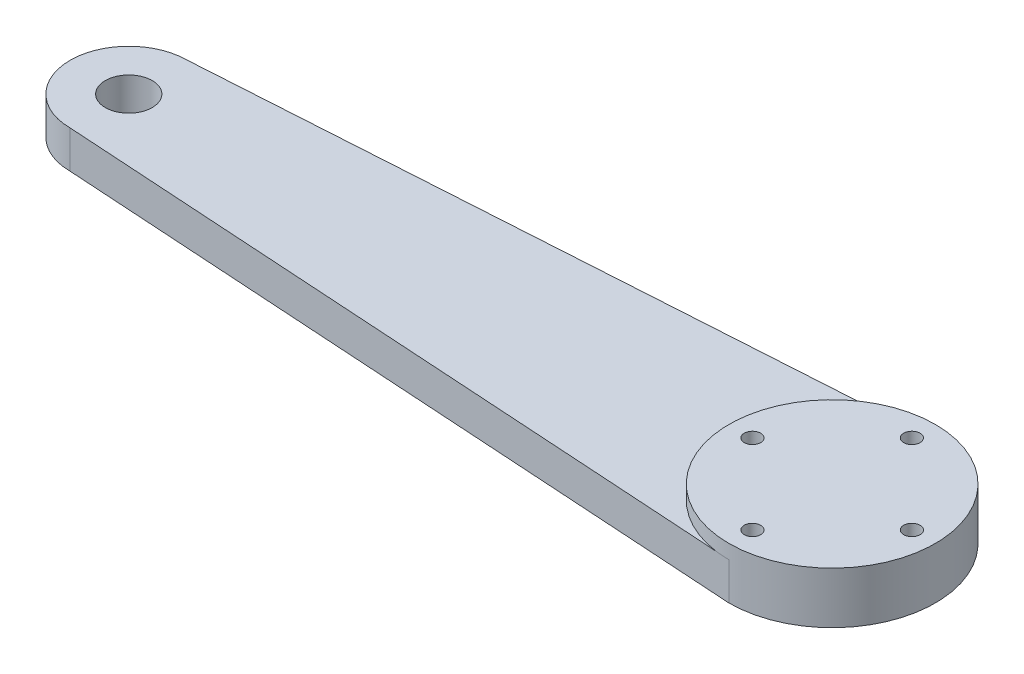
ISO-10303-21;
HEADER;
FILE_DESCRIPTION(('STEP AP214'),'2;1');
FILE_NAME('part.step','',(''),(''),'','','');
FILE_SCHEMA(('AUTOMOTIVE_DESIGN { 1 0 10303 214 1 1 1 1 }'));
ENDSEC;
DATA;
#1=APPLICATION_CONTEXT('core data for automotive mechanical design processes');
#2=APPLICATION_PROTOCOL_DEFINITION('international standard','automotive_design',2000,#1);
#3=PRODUCT_CONTEXT('',#1,'mechanical');
#4=PRODUCT('Part','Part','',(#3));
#5=PRODUCT_RELATED_PRODUCT_CATEGORY('part','',(#4));
#6=PRODUCT_DEFINITION_FORMATION('','',#4);
#7=PRODUCT_DEFINITION_CONTEXT('part definition',#1,'design');
#8=PRODUCT_DEFINITION('design','',#6,#7);
#9=PRODUCT_DEFINITION_SHAPE('','',#8);
#10=(LENGTH_UNIT() NAMED_UNIT(*) SI_UNIT(.MILLI.,.METRE.));
#11=(NAMED_UNIT(*) PLANE_ANGLE_UNIT() SI_UNIT($,.RADIAN.));
#12=(NAMED_UNIT(*) SI_UNIT($,.STERADIAN.) SOLID_ANGLE_UNIT());
#13=UNCERTAINTY_MEASURE_WITH_UNIT(LENGTH_MEASURE(1.E-05),#10,'distance_accuracy_value','');
#14=(GEOMETRIC_REPRESENTATION_CONTEXT(3) GLOBAL_UNCERTAINTY_ASSIGNED_CONTEXT((#13)) GLOBAL_UNIT_ASSIGNED_CONTEXT((#10,
#11,#12)) REPRESENTATION_CONTEXT('',''));
#15=CARTESIAN_POINT('',(0.,0.,0.));
#16=DIRECTION('',(0.,0.,1.));
#17=DIRECTION('',(1.,0.,0.));
#18=AXIS2_PLACEMENT_3D('',#15,#16,#17);
#19=CARTESIAN_POINT('',(0.,8.,-17.));
#20=DIRECTION('',(0.,-1.,0.));
#21=DIRECTION('',(0.,0.,-1.));
#22=AXIS2_PLACEMENT_3D('',#19,#20,#21);
#23=CYLINDRICAL_SURFACE('',#22,1.75);
#24=CARTESIAN_POINT('',(0.,11.,-17.));
#25=DIRECTION('',(0.,1.,0.));
#26=DIRECTION('',(0.,0.,1.));
#27=AXIS2_PLACEMENT_3D('',#24,#25,#26);
#28=CIRCLE('',#27,1.75);
#29=CARTESIAN_POINT('',(0.,11.,-15.25));
#30=VERTEX_POINT('',#29);
#31=EDGE_CURVE('E403',#30,#30,#28,.T.);
#32=ORIENTED_EDGE('',*,*,#31,.T.);
#33=EDGE_LOOP('',(#32));
#34=FACE_BOUND('',#33,.T.);
#35=CARTESIAN_POINT('',(0.,4.,-17.));
#36=DIRECTION('',(0.,-1.,0.));
#37=DIRECTION('',(0.,0.,-1.));
#38=AXIS2_PLACEMENT_3D('',#35,#36,#37);
#39=CIRCLE('',#38,1.75);
#40=CARTESIAN_POINT('',(0.,4.,-18.75));
#41=VERTEX_POINT('',#40);
#42=EDGE_CURVE('E399',#41,#41,#39,.T.);
#43=ORIENTED_EDGE('',*,*,#42,.T.);
#44=EDGE_LOOP('',(#43));
#45=FACE_BOUND('',#44,.T.);
#46=ADVANCED_FACE('F37',(#34,#45),#23,.F.);
#47=CARTESIAN_POINT('',(17.,8.,0.));
#48=DIRECTION('',(0.,-1.,0.));
#49=DIRECTION('',(0.,0.,-1.));
#50=AXIS2_PLACEMENT_3D('',#47,#48,#49);
#51=CYLINDRICAL_SURFACE('',#50,1.75);
#52=CARTESIAN_POINT('',(17.,11.,0.));
#53=DIRECTION('',(0.,1.,0.));
#54=DIRECTION('',(0.,0.,1.));
#55=AXIS2_PLACEMENT_3D('',#52,#53,#54);
#56=CIRCLE('',#55,1.75);
#57=CARTESIAN_POINT('',(17.,11.,1.75000000000006));
#58=VERTEX_POINT('',#57);
#59=EDGE_CURVE('E406',#58,#58,#56,.T.);
#60=ORIENTED_EDGE('',*,*,#59,.T.);
#61=EDGE_LOOP('',(#60));
#62=FACE_BOUND('',#61,.T.);
#63=CARTESIAN_POINT('',(17.,4.,0.));
#64=DIRECTION('',(0.,-1.,0.));
#65=DIRECTION('',(0.,0.,-1.));
#66=AXIS2_PLACEMENT_3D('',#63,#64,#65);
#67=CIRCLE('',#66,1.75);
#68=CARTESIAN_POINT('',(17.,4.,-1.74999999999994));
#69=VERTEX_POINT('',#68);
#70=EDGE_CURVE('E415',#69,#69,#67,.T.);
#71=ORIENTED_EDGE('',*,*,#70,.T.);
#72=EDGE_LOOP('',(#71));
#73=FACE_BOUND('',#72,.T.);
#74=ADVANCED_FACE('F160',(#62,#73),#51,.F.);
#75=CARTESIAN_POINT('',(-1.18710365520667E-13,8.,17.));
#76=DIRECTION('',(0.,-1.,0.));
#77=DIRECTION('',(0.,0.,-1.));
#78=AXIS2_PLACEMENT_3D('',#75,#76,#77);
#79=CYLINDRICAL_SURFACE('',#78,1.75);
#80=CARTESIAN_POINT('',(-1.18710365520667E-13,11.,17.));
#81=DIRECTION('',(0.,1.,0.));
#82=DIRECTION('',(0.,0.,1.));
#83=AXIS2_PLACEMENT_3D('',#80,#81,#82);
#84=CIRCLE('',#83,1.75);
#85=CARTESIAN_POINT('',(-1.18710365520667E-13,11.,18.75));
#86=VERTEX_POINT('',#85);
#87=EDGE_CURVE('E441',#86,#86,#84,.T.);
#88=ORIENTED_EDGE('',*,*,#87,.T.);
#89=EDGE_LOOP('',(#88));
#90=FACE_BOUND('',#89,.T.);
#91=CARTESIAN_POINT('',(-1.18710365520667E-13,4.,17.));
#92=DIRECTION('',(0.,-1.,0.));
#93=DIRECTION('',(0.,0.,-1.));
#94=AXIS2_PLACEMENT_3D('',#91,#92,#93);
#95=CIRCLE('',#94,1.75);
#96=CARTESIAN_POINT('',(-1.18710365520667E-13,4.,15.25));
#97=VERTEX_POINT('',#96);
#98=EDGE_CURVE('E419',#97,#97,#95,.T.);
#99=ORIENTED_EDGE('',*,*,#98,.T.);
#100=EDGE_LOOP('',(#99));
#101=FACE_BOUND('',#100,.T.);
#102=ADVANCED_FACE('F166',(#90,#101),#79,.F.);
#103=CARTESIAN_POINT('',(-17.,8.,-1.78065548281E-13));
#104=DIRECTION('',(0.,-1.,0.));
#105=DIRECTION('',(0.,0.,-1.));
#106=AXIS2_PLACEMENT_3D('',#103,#104,#105);
#107=CYLINDRICAL_SURFACE('',#106,1.75);
#108=CARTESIAN_POINT('',(-17.,11.,-1.78065548281E-13));
#109=DIRECTION('',(0.,1.,0.));
#110=DIRECTION('',(0.,0.,1.));
#111=AXIS2_PLACEMENT_3D('',#108,#109,#110);
#112=CIRCLE('',#111,1.75);
#113=CARTESIAN_POINT('',(-17.,11.,1.74999999999982));
#114=VERTEX_POINT('',#113);
#115=EDGE_CURVE('E106',#114,#114,#112,.T.);
#116=ORIENTED_EDGE('',*,*,#115,.T.);
#117=EDGE_LOOP('',(#116));
#118=FACE_BOUND('',#117,.T.);
#119=CARTESIAN_POINT('',(-17.,4.,-1.78065548281E-13));
#120=DIRECTION('',(0.,-1.,0.));
#121=DIRECTION('',(0.,0.,-1.));
#122=AXIS2_PLACEMENT_3D('',#119,#120,#121);
#123=CIRCLE('',#122,1.75);
#124=CARTESIAN_POINT('',(-17.,4.,-1.75000000000018));
#125=VERTEX_POINT('',#124);
#126=EDGE_CURVE('E428',#125,#125,#123,.T.);
#127=ORIENTED_EDGE('',*,*,#126,.T.);
#128=EDGE_LOOP('',(#127));
#129=FACE_BOUND('',#128,.T.);
#130=ADVANCED_FACE('F178',(#118,#129),#107,.F.);
#131=CARTESIAN_POINT('',(-150.,8.,0.));
#132=DIRECTION('',(0.,1.,0.));
#133=DIRECTION('',(0.,0.,1.));
#134=AXIS2_PLACEMENT_3D('',#131,#132,#133);
#135=PLANE('',#134);
#136=CARTESIAN_POINT('',(0.,8.,0.));
#137=DIRECTION('',(0.,1.,0.));
#138=DIRECTION('',(0.,0.,1.));
#139=AXIS2_PLACEMENT_3D('',#136,#137,#138);
#140=CIRCLE('',#139,22.);
#141=CARTESIAN_POINT('',(-2.7755336926329,8.,-21.8242161994666));
#142=VERTEX_POINT('',#141);
#143=CARTESIAN_POINT('',(-2.7755336926329,8.,21.8242161994666));
#144=VERTEX_POINT('',#143);
#145=EDGE_CURVE('E11',#142,#144,#140,.T.);
#146=ORIENTED_EDGE('',*,*,#145,.F.);
#147=DIRECTION('',(-0.99800045772747,0.,0.0632066956560731));
#148=VECTOR('',#147,1.);
#149=CARTESIAN_POINT('',(-150.,8.,-12.5));
#150=LINE('',#149,#148);
#151=CARTESIAN_POINT('',(-150.,8.,-12.5));
#152=VERTEX_POINT('',#151);
#153=EDGE_CURVE('E58',#142,#152,#150,.T.);
#154=ORIENTED_EDGE('',*,*,#153,.T.);
#155=CARTESIAN_POINT('',(-150.,8.,0.));
#156=DIRECTION('',(0.,1.,0.));
#157=DIRECTION('',(0.,0.,1.));
#158=AXIS2_PLACEMENT_3D('',#155,#156,#157);
#159=CIRCLE('',#158,12.5);
#160=CARTESIAN_POINT('',(-150.,8.,12.5));
#161=VERTEX_POINT('',#160);
#162=EDGE_CURVE('E93',#152,#161,#159,.T.);
#163=ORIENTED_EDGE('',*,*,#162,.T.);
#164=DIRECTION('',(0.99800045772747,0.,0.0632066956560731));
#165=VECTOR('',#164,1.);
#166=CARTESIAN_POINT('',(-150.,8.,12.5));
#167=LINE('',#166,#165);
#168=EDGE_CURVE('E87',#161,#144,#167,.T.);
#169=ORIENTED_EDGE('',*,*,#168,.T.);
#170=EDGE_LOOP('',(#146,#154,#163,#169));
#171=FACE_BOUND('',#170,.T.);
#172=CARTESIAN_POINT('',(-150.,8.,0.));
#173=DIRECTION('',(0.,1.,0.));
#174=DIRECTION('',(0.,0.,1.));
#175=AXIS2_PLACEMENT_3D('',#172,#173,#174);
#176=CIRCLE('',#175,5.00000000000002);
#177=CARTESIAN_POINT('',(-150.,8.,5.00000000000002));
#178=VERTEX_POINT('',#177);
#179=EDGE_CURVE('E121',#178,#178,#176,.T.);
#180=ORIENTED_EDGE('',*,*,#179,.F.);
#181=EDGE_LOOP('',(#180));
#182=FACE_BOUND('',#181,.T.);
#183=ADVANCED_FACE('F90',(#171,#182),#135,.T.);
#184=CARTESIAN_POINT('',(-150.,0.,0.));
#185=DIRECTION('',(0.,1.,0.));
#186=DIRECTION('',(0.,0.,1.));
#187=AXIS2_PLACEMENT_3D('',#184,#185,#186);
#188=PLANE('',#187);
#189=CARTESIAN_POINT('',(0.,0.,-17.));
#190=DIRECTION('',(0.,-1.,0.));
#191=DIRECTION('',(0.,0.,-1.));
#192=AXIS2_PLACEMENT_3D('',#189,#190,#191);
#193=CIRCLE('',#192,3.25);
#194=CARTESIAN_POINT('',(0.,0.,-20.25));
#195=VERTEX_POINT('',#194);
#196=EDGE_CURVE('E404',#195,#195,#193,.T.);
#197=ORIENTED_EDGE('',*,*,#196,.F.);
#198=EDGE_LOOP('',(#197));
#199=FACE_BOUND('',#198,.T.);
#200=CARTESIAN_POINT('',(17.,0.,0.));
#201=DIRECTION('',(0.,-1.,0.));
#202=DIRECTION('',(0.,0.,-1.));
#203=AXIS2_PLACEMENT_3D('',#200,#201,#202);
#204=CIRCLE('',#203,3.25);
#205=CARTESIAN_POINT('',(17.,0.,-3.24999999999994));
#206=VERTEX_POINT('',#205);
#207=EDGE_CURVE('E412',#206,#206,#204,.T.);
#208=ORIENTED_EDGE('',*,*,#207,.F.);
#209=EDGE_LOOP('',(#208));
#210=FACE_BOUND('',#209,.T.);
#211=CARTESIAN_POINT('',(-1.18710365520667E-13,0.,17.));
#212=DIRECTION('',(0.,-1.,0.));
#213=DIRECTION('',(0.,0.,-1.));
#214=AXIS2_PLACEMENT_3D('',#211,#212,#213);
#215=CIRCLE('',#214,3.25);
#216=CARTESIAN_POINT('',(-1.18710365520667E-13,0.,13.75));
#217=VERTEX_POINT('',#216);
#218=EDGE_CURVE('E422',#217,#217,#215,.T.);
#219=ORIENTED_EDGE('',*,*,#218,.F.);
#220=EDGE_LOOP('',(#219));
#221=FACE_BOUND('',#220,.T.);
#222=CARTESIAN_POINT('',(-17.,0.,-1.78065548281E-13));
#223=DIRECTION('',(0.,-1.,0.));
#224=DIRECTION('',(0.,0.,-1.));
#225=AXIS2_PLACEMENT_3D('',#222,#223,#224);
#226=CIRCLE('',#225,3.25);
#227=CARTESIAN_POINT('',(-17.,0.,-3.25000000000018));
#228=VERTEX_POINT('',#227);
#229=EDGE_CURVE('E431',#228,#228,#226,.T.);
#230=ORIENTED_EDGE('',*,*,#229,.F.);
#231=EDGE_LOOP('',(#230));
#232=FACE_BOUND('',#231,.T.);
#233=CARTESIAN_POINT('',(-150.,0.,0.));
#234=DIRECTION('',(0.,1.,0.));
#235=DIRECTION('',(0.,0.,1.));
#236=AXIS2_PLACEMENT_3D('',#233,#234,#235);
#237=CIRCLE('',#236,12.5);
#238=CARTESIAN_POINT('',(-150.,0.,-12.5));
#239=VERTEX_POINT('',#238);
#240=CARTESIAN_POINT('',(-150.,0.,12.5));
#241=VERTEX_POINT('',#240);
#242=EDGE_CURVE('E124',#239,#241,#237,.T.);
#243=ORIENTED_EDGE('',*,*,#242,.F.);
#244=DIRECTION('',(-0.99800045772747,0.,0.0632066956560731));
#245=VECTOR('',#244,1.);
#246=CARTESIAN_POINT('',(-150.,0.,-12.5));
#247=LINE('',#246,#245);
#248=CARTESIAN_POINT('',(0.,0.,-22.));
#249=VERTEX_POINT('',#248);
#250=EDGE_CURVE('E80',#249,#239,#247,.T.);
#251=ORIENTED_EDGE('',*,*,#250,.F.);
#252=CARTESIAN_POINT('',(0.,0.,0.));
#253=DIRECTION('',(0.,1.,0.));
#254=DIRECTION('',(0.,0.,1.));
#255=AXIS2_PLACEMENT_3D('',#252,#253,#254);
#256=CIRCLE('',#255,22.);
#257=CARTESIAN_POINT('',(0.,0.,22.));
#258=VERTEX_POINT('',#257);
#259=EDGE_CURVE('E135',#258,#249,#256,.T.);
#260=ORIENTED_EDGE('',*,*,#259,.F.);
#261=DIRECTION('',(0.99800045772747,0.,0.0632066956560731));
#262=VECTOR('',#261,1.);
#263=CARTESIAN_POINT('',(-150.,0.,12.5));
#264=LINE('',#263,#262);
#265=EDGE_CURVE('E133',#241,#258,#264,.T.);
#266=ORIENTED_EDGE('',*,*,#265,.F.);
#267=EDGE_LOOP('',(#243,#251,#260,#266));
#268=FACE_BOUND('',#267,.T.);
#269=CARTESIAN_POINT('',(-150.,0.,0.));
#270=DIRECTION('',(0.,1.,0.));
#271=DIRECTION('',(0.,0.,1.));
#272=AXIS2_PLACEMENT_3D('',#269,#270,#271);
#273=CIRCLE('',#272,5.00000000000002);
#274=CARTESIAN_POINT('',(-150.,0.,5.00000000000002));
#275=VERTEX_POINT('',#274);
#276=EDGE_CURVE('E117',#275,#275,#273,.T.);
#277=ORIENTED_EDGE('',*,*,#276,.T.);
#278=EDGE_LOOP('',(#277));
#279=FACE_BOUND('',#278,.T.);
#280=ADVANCED_FACE('F143',(#199,#210,#221,#232,#268,#279),#188,.F.);
#281=CARTESIAN_POINT('',(-150.,8.,0.));
#282=DIRECTION('',(0.,-1.,0.));
#283=DIRECTION('',(0.,0.,-1.));
#284=AXIS2_PLACEMENT_3D('',#281,#282,#283);
#285=CYLINDRICAL_SURFACE('',#284,12.5);
#286=ORIENTED_EDGE('',*,*,#242,.T.);
#287=DIRECTION('',(0.,-1.,0.));
#288=VECTOR('',#287,1.);
#289=CARTESIAN_POINT('',(-150.,8.,12.5));
#290=LINE('',#289,#288);
#291=EDGE_CURVE('E41',#161,#241,#290,.T.);
#292=ORIENTED_EDGE('',*,*,#291,.F.);
#293=ORIENTED_EDGE('',*,*,#162,.F.);
#294=DIRECTION('',(0.,-1.,0.));
#295=VECTOR('',#294,1.);
#296=CARTESIAN_POINT('',(-150.,8.,-12.5));
#297=LINE('',#296,#295);
#298=EDGE_CURVE('E130',#152,#239,#297,.T.);
#299=ORIENTED_EDGE('',*,*,#298,.T.);
#300=EDGE_LOOP('',(#286,#292,#293,#299));
#301=FACE_BOUND('',#300,.T.);
#302=ADVANCED_FACE('F39',(#301),#285,.T.);
#303=CARTESIAN_POINT('',(-150.,8.,12.5));
#304=DIRECTION('',(0.0632066956560731,0.,-0.99800045772747));
#305=DIRECTION('',(-0.99800045772747,0.,-0.0632066956560731));
#306=AXIS2_PLACEMENT_3D('',#303,#304,#305);
#307=PLANE('',#306);
#308=ORIENTED_EDGE('',*,*,#265,.T.);
#309=DIRECTION('',(0.,-1.,0.));
#310=VECTOR('',#309,1.);
#311=CARTESIAN_POINT('',(0.,8.,22.));
#312=LINE('',#311,#310);
#313=CARTESIAN_POINT('',(0.,8.,22.));
#314=VERTEX_POINT('',#313);
#315=EDGE_CURVE('E101',#314,#258,#312,.T.);
#316=ORIENTED_EDGE('',*,*,#315,.F.);
#317=EDGE_CURVE('E95',#144,#314,#167,.T.);
#318=ORIENTED_EDGE('',*,*,#317,.F.);
#319=ORIENTED_EDGE('',*,*,#168,.F.);
#320=ORIENTED_EDGE('',*,*,#291,.T.);
#321=EDGE_LOOP('',(#308,#316,#318,#319,#320));
#322=FACE_BOUND('',#321,.T.);
#323=ADVANCED_FACE('F99',(#322),#307,.F.);
#324=CARTESIAN_POINT('',(0.,8.,0.));
#325=DIRECTION('',(0.,-1.,0.));
#326=DIRECTION('',(0.,0.,-1.));
#327=AXIS2_PLACEMENT_3D('',#324,#325,#326);
#328=CYLINDRICAL_SURFACE('',#327,22.);
#329=ORIENTED_EDGE('',*,*,#259,.T.);
#330=DIRECTION('',(0.,-1.,0.));
#331=VECTOR('',#330,1.);
#332=CARTESIAN_POINT('',(0.,8.,-22.));
#333=LINE('',#332,#331);
#334=CARTESIAN_POINT('',(0.,8.,-22.));
#335=VERTEX_POINT('',#334);
#336=EDGE_CURVE('E111',#335,#249,#333,.T.);
#337=ORIENTED_EDGE('',*,*,#336,.F.);
#338=EDGE_CURVE('E48',#335,#142,#140,.T.);
#339=ORIENTED_EDGE('',*,*,#338,.T.);
#340=ORIENTED_EDGE('',*,*,#145,.T.);
#341=EDGE_CURVE('E47',#144,#314,#140,.T.);
#342=ORIENTED_EDGE('',*,*,#341,.T.);
#343=ORIENTED_EDGE('',*,*,#315,.T.);
#344=EDGE_LOOP('',(#329,#337,#339,#340,#342,#343));
#345=FACE_BOUND('',#344,.T.);
#346=CARTESIAN_POINT('',(0.,11.,0.));
#347=DIRECTION('',(0.,1.,0.));
#348=DIRECTION('',(0.,0.,1.));
#349=AXIS2_PLACEMENT_3D('',#346,#347,#348);
#350=CIRCLE('',#349,22.);
#351=CARTESIAN_POINT('',(0.,11.,22.));
#352=VERTEX_POINT('',#351);
#353=EDGE_CURVE('E115',#352,#352,#350,.T.);
#354=ORIENTED_EDGE('',*,*,#353,.F.);
#355=EDGE_LOOP('',(#354));
#356=FACE_BOUND('',#355,.T.);
#357=ADVANCED_FACE('F108',(#345,#356),#328,.T.);
#358=CARTESIAN_POINT('',(-150.,8.,-12.5));
#359=DIRECTION('',(0.0632066956560731,0.,0.99800045772747));
#360=DIRECTION('',(0.99800045772747,0.,-0.0632066956560731));
#361=AXIS2_PLACEMENT_3D('',#358,#359,#360);
#362=PLANE('',#361);
#363=ORIENTED_EDGE('',*,*,#250,.T.);
#364=ORIENTED_EDGE('',*,*,#298,.F.);
#365=ORIENTED_EDGE('',*,*,#153,.F.);
#366=EDGE_CURVE('E128',#335,#142,#150,.T.);
#367=ORIENTED_EDGE('',*,*,#366,.F.);
#368=ORIENTED_EDGE('',*,*,#336,.T.);
#369=EDGE_LOOP('',(#363,#364,#365,#367,#368));
#370=FACE_BOUND('',#369,.T.);
#371=ADVANCED_FACE('F145',(#370),#362,.F.);
#372=CARTESIAN_POINT('',(-150.,8.,0.));
#373=DIRECTION('',(0.,-1.,0.));
#374=DIRECTION('',(0.,0.,-1.));
#375=AXIS2_PLACEMENT_3D('',#372,#373,#374);
#376=CYLINDRICAL_SURFACE('',#375,5.00000000000002);
#377=ORIENTED_EDGE('',*,*,#179,.T.);
#378=EDGE_LOOP('',(#377));
#379=FACE_BOUND('',#378,.T.);
#380=ORIENTED_EDGE('',*,*,#276,.F.);
#381=EDGE_LOOP('',(#380));
#382=FACE_BOUND('',#381,.T.);
#383=ADVANCED_FACE('F157',(#379,#382),#376,.F.);
#384=CARTESIAN_POINT('',(0.,8.,0.));
#385=DIRECTION('',(0.,1.,0.));
#386=DIRECTION('',(0.,0.,1.));
#387=AXIS2_PLACEMENT_3D('',#384,#385,#386);
#388=PLANE('',#387);
#389=ORIENTED_EDGE('',*,*,#341,.F.);
#390=ORIENTED_EDGE('',*,*,#317,.T.);
#391=EDGE_LOOP('',(#389,#390));
#392=FACE_BOUND('',#391,.T.);
#393=ADVANCED_FACE('F104',(#392),#388,.F.);
#394=ORIENTED_EDGE('',*,*,#338,.F.);
#395=ORIENTED_EDGE('',*,*,#366,.T.);
#396=EDGE_LOOP('',(#394,#395));
#397=FACE_BOUND('',#396,.T.);
#398=ADVANCED_FACE('F146',(#397),#388,.F.);
#399=CARTESIAN_POINT('',(0.,11.,0.));
#400=DIRECTION('',(0.,1.,0.));
#401=DIRECTION('',(0.,0.,1.));
#402=AXIS2_PLACEMENT_3D('',#399,#400,#401);
#403=PLANE('',#402);
#404=ORIENTED_EDGE('',*,*,#59,.F.);
#405=EDGE_LOOP('',(#404));
#406=FACE_BOUND('',#405,.T.);
#407=ORIENTED_EDGE('',*,*,#115,.F.);
#408=EDGE_LOOP('',(#407));
#409=FACE_BOUND('',#408,.T.);
#410=ORIENTED_EDGE('',*,*,#353,.T.);
#411=EDGE_LOOP('',(#410));
#412=FACE_BOUND('',#411,.T.);
#413=ORIENTED_EDGE('',*,*,#87,.F.);
#414=EDGE_LOOP('',(#413));
#415=FACE_BOUND('',#414,.T.);
#416=ORIENTED_EDGE('',*,*,#31,.F.);
#417=EDGE_LOOP('',(#416));
#418=FACE_BOUND('',#417,.T.);
#419=ADVANCED_FACE('F148',(#406,#409,#412,#415,#418),#403,.T.);
#420=CARTESIAN_POINT('',(-17.,4.,-1.78065548281E-13));
#421=DIRECTION('',(0.,-1.,0.));
#422=DIRECTION('',(0.,0.,-1.));
#423=AXIS2_PLACEMENT_3D('',#420,#421,#422);
#424=CYLINDRICAL_SURFACE('',#423,3.25);
#425=CARTESIAN_POINT('',(-17.,4.,-1.78065548281E-13));
#426=DIRECTION('',(0.,-1.,0.));
#427=DIRECTION('',(0.,0.,-1.));
#428=AXIS2_PLACEMENT_3D('',#425,#426,#427);
#429=CIRCLE('',#428,3.25);
#430=CARTESIAN_POINT('',(-17.,4.,-3.25000000000018));
#431=VERTEX_POINT('',#430);
#432=EDGE_CURVE('E434',#431,#431,#429,.T.);
#433=ORIENTED_EDGE('',*,*,#432,.F.);
#434=EDGE_LOOP('',(#433));
#435=FACE_BOUND('',#434,.T.);
#436=ORIENTED_EDGE('',*,*,#229,.T.);
#437=EDGE_LOOP('',(#436));
#438=FACE_BOUND('',#437,.T.);
#439=ADVANCED_FACE('F154',(#435,#438),#424,.F.);
#440=CARTESIAN_POINT('',(-17.,4.,-1.78065548281E-13));
#441=DIRECTION('',(0.,-1.,0.));
#442=DIRECTION('',(0.,0.,-1.));
#443=AXIS2_PLACEMENT_3D('',#440,#441,#442);
#444=PLANE('',#443);
#445=ORIENTED_EDGE('',*,*,#126,.F.);
#446=EDGE_LOOP('',(#445));
#447=FACE_BOUND('',#446,.T.);
#448=ORIENTED_EDGE('',*,*,#432,.T.);
#449=EDGE_LOOP('',(#448));
#450=FACE_BOUND('',#449,.T.);
#451=ADVANCED_FACE('F308',(#447,#450),#444,.T.);
#452=CARTESIAN_POINT('',(-1.18710365520667E-13,4.,17.));
#453=DIRECTION('',(0.,-1.,0.));
#454=DIRECTION('',(0.,0.,-1.));
#455=AXIS2_PLACEMENT_3D('',#452,#453,#454);
#456=CYLINDRICAL_SURFACE('',#455,3.25);
#457=CARTESIAN_POINT('',(-1.18710365520667E-13,4.,17.));
#458=DIRECTION('',(0.,-1.,0.));
#459=DIRECTION('',(0.,0.,-1.));
#460=AXIS2_PLACEMENT_3D('',#457,#458,#459);
#461=CIRCLE('',#460,3.25);
#462=CARTESIAN_POINT('',(-1.18710365520667E-13,4.,13.75));
#463=VERTEX_POINT('',#462);
#464=EDGE_CURVE('E425',#463,#463,#461,.T.);
#465=ORIENTED_EDGE('',*,*,#464,.F.);
#466=EDGE_LOOP('',(#465));
#467=FACE_BOUND('',#466,.T.);
#468=ORIENTED_EDGE('',*,*,#218,.T.);
#469=EDGE_LOOP('',(#468));
#470=FACE_BOUND('',#469,.T.);
#471=ADVANCED_FACE('F319',(#467,#470),#456,.F.);
#472=CARTESIAN_POINT('',(-1.18710365520667E-13,4.,17.));
#473=DIRECTION('',(0.,-1.,0.));
#474=DIRECTION('',(0.,0.,-1.));
#475=AXIS2_PLACEMENT_3D('',#472,#473,#474);
#476=PLANE('',#475);
#477=ORIENTED_EDGE('',*,*,#98,.F.);
#478=EDGE_LOOP('',(#477));
#479=FACE_BOUND('',#478,.T.);
#480=ORIENTED_EDGE('',*,*,#464,.T.);
#481=EDGE_LOOP('',(#480));
#482=FACE_BOUND('',#481,.T.);
#483=ADVANCED_FACE('F330',(#479,#482),#476,.T.);
#484=CARTESIAN_POINT('',(17.,4.,0.));
#485=DIRECTION('',(0.,-1.,0.));
#486=DIRECTION('',(0.,0.,-1.));
#487=AXIS2_PLACEMENT_3D('',#484,#485,#486);
#488=CYLINDRICAL_SURFACE('',#487,3.25);
#489=CARTESIAN_POINT('',(17.,4.,0.));
#490=DIRECTION('',(0.,-1.,0.));
#491=DIRECTION('',(0.,0.,-1.));
#492=AXIS2_PLACEMENT_3D('',#489,#490,#491);
#493=CIRCLE('',#492,3.25);
#494=CARTESIAN_POINT('',(17.,4.,-3.24999999999994));
#495=VERTEX_POINT('',#494);
#496=EDGE_CURVE('E416',#495,#495,#493,.T.);
#497=ORIENTED_EDGE('',*,*,#496,.F.);
#498=EDGE_LOOP('',(#497));
#499=FACE_BOUND('',#498,.T.);
#500=ORIENTED_EDGE('',*,*,#207,.T.);
#501=EDGE_LOOP('',(#500));
#502=FACE_BOUND('',#501,.T.);
#503=ADVANCED_FACE('F341',(#499,#502),#488,.F.);
#504=CARTESIAN_POINT('',(17.,4.,0.));
#505=DIRECTION('',(0.,-1.,0.));
#506=DIRECTION('',(0.,0.,-1.));
#507=AXIS2_PLACEMENT_3D('',#504,#505,#506);
#508=PLANE('',#507);
#509=ORIENTED_EDGE('',*,*,#70,.F.);
#510=EDGE_LOOP('',(#509));
#511=FACE_BOUND('',#510,.T.);
#512=ORIENTED_EDGE('',*,*,#496,.T.);
#513=EDGE_LOOP('',(#512));
#514=FACE_BOUND('',#513,.T.);
#515=ADVANCED_FACE('F352',(#511,#514),#508,.T.);
#516=CARTESIAN_POINT('',(0.,4.,-17.));
#517=DIRECTION('',(0.,-1.,0.));
#518=DIRECTION('',(0.,0.,-1.));
#519=AXIS2_PLACEMENT_3D('',#516,#517,#518);
#520=CYLINDRICAL_SURFACE('',#519,3.25);
#521=CARTESIAN_POINT('',(0.,4.,-17.));
#522=DIRECTION('',(0.,-1.,0.));
#523=DIRECTION('',(0.,0.,-1.));
#524=AXIS2_PLACEMENT_3D('',#521,#522,#523);
#525=CIRCLE('',#524,3.25);
#526=CARTESIAN_POINT('',(0.,4.,-20.25));
#527=VERTEX_POINT('',#526);
#528=EDGE_CURVE('E402',#527,#527,#525,.T.);
#529=ORIENTED_EDGE('',*,*,#528,.F.);
#530=EDGE_LOOP('',(#529));
#531=FACE_BOUND('',#530,.T.);
#532=ORIENTED_EDGE('',*,*,#196,.T.);
#533=EDGE_LOOP('',(#532));
#534=FACE_BOUND('',#533,.T.);
#535=ADVANCED_FACE('F363',(#531,#534),#520,.F.);
#536=CARTESIAN_POINT('',(0.,4.,-17.));
#537=DIRECTION('',(0.,-1.,0.));
#538=DIRECTION('',(0.,0.,-1.));
#539=AXIS2_PLACEMENT_3D('',#536,#537,#538);
#540=PLANE('',#539);
#541=ORIENTED_EDGE('',*,*,#42,.F.);
#542=EDGE_LOOP('',(#541));
#543=FACE_BOUND('',#542,.T.);
#544=ORIENTED_EDGE('',*,*,#528,.T.);
#545=EDGE_LOOP('',(#544));
#546=FACE_BOUND('',#545,.T.);
#547=ADVANCED_FACE('F374',(#543,#546),#540,.T.);
#548=CLOSED_SHELL('',(#46,#74,#102,#130,#183,#280,#302,#323,#357,#371,#383,#393,#398,#419,#439,
#451,#471,#483,#503,#515,#535,#547));
#549=MANIFOLD_SOLID_BREP('B2',#548);
#550=ADVANCED_BREP_SHAPE_REPRESENTATION('',(#18,#549),#14);
#551=SHAPE_DEFINITION_REPRESENTATION(#9,#550);
ENDSEC;
END-ISO-10303-21;
